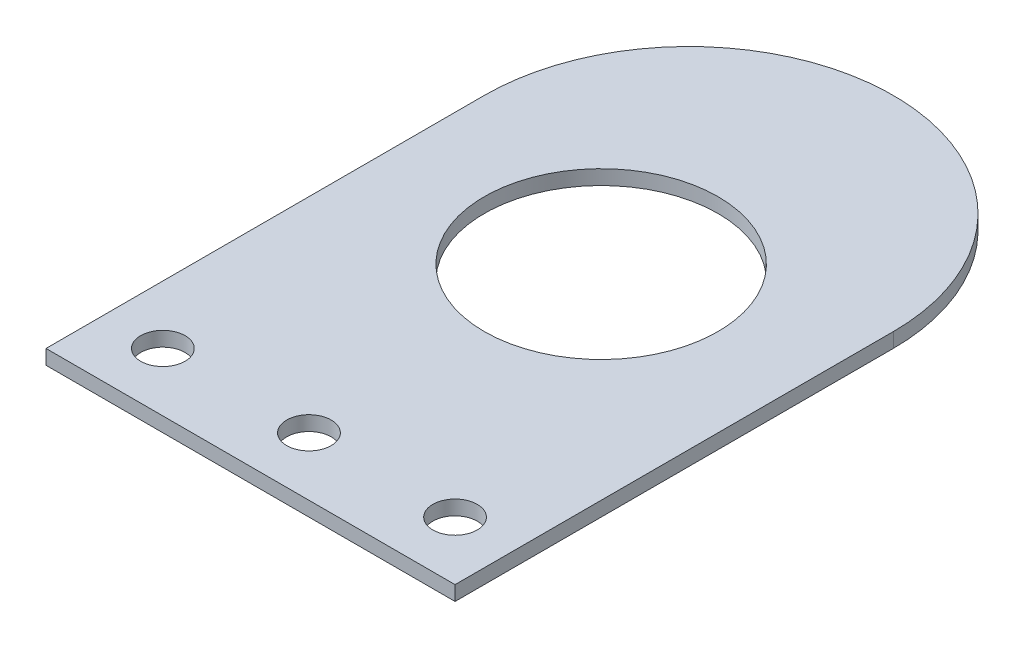
ISO-10303-21;
HEADER;
FILE_DESCRIPTION(('STEP AP214'),'2;1');
FILE_NAME('part.step','',(''),(''),'','','');
FILE_SCHEMA(('AUTOMOTIVE_DESIGN { 1 0 10303 214 1 1 1 1 }'));
ENDSEC;
DATA;
#1=APPLICATION_CONTEXT('core data for automotive mechanical design processes');
#2=APPLICATION_PROTOCOL_DEFINITION('international standard','automotive_design',2000,#1);
#3=PRODUCT_CONTEXT('',#1,'mechanical');
#4=PRODUCT('Part','Part','',(#3));
#5=PRODUCT_RELATED_PRODUCT_CATEGORY('part','',(#4));
#6=PRODUCT_DEFINITION_FORMATION('','',#4);
#7=PRODUCT_DEFINITION_CONTEXT('part definition',#1,'design');
#8=PRODUCT_DEFINITION('design','',#6,#7);
#9=PRODUCT_DEFINITION_SHAPE('','',#8);
#10=(LENGTH_UNIT() NAMED_UNIT(*) SI_UNIT(.MILLI.,.METRE.));
#11=(NAMED_UNIT(*) PLANE_ANGLE_UNIT() SI_UNIT($,.RADIAN.));
#12=(NAMED_UNIT(*) SI_UNIT($,.STERADIAN.) SOLID_ANGLE_UNIT());
#13=UNCERTAINTY_MEASURE_WITH_UNIT(LENGTH_MEASURE(1.E-05),#10,'distance_accuracy_value','');
#14=(GEOMETRIC_REPRESENTATION_CONTEXT(3) GLOBAL_UNCERTAINTY_ASSIGNED_CONTEXT((#13)) GLOBAL_UNIT_ASSIGNED_CONTEXT((#10,
#11,#12)) REPRESENTATION_CONTEXT('',''));
#15=CARTESIAN_POINT('',(0.,0.,0.));
#16=DIRECTION('',(0.,0.,1.));
#17=DIRECTION('',(1.,0.,0.));
#18=AXIS2_PLACEMENT_3D('',#15,#16,#17);
#19=CARTESIAN_POINT('',(0.,-1.5875,0.));
#20=DIRECTION('',(0.,1.,0.));
#21=DIRECTION('',(0.,0.,1.));
#22=AXIS2_PLACEMENT_3D('',#19,#20,#21);
#23=CYLINDRICAL_SURFACE('',#22,22.225);
#24=CARTESIAN_POINT('',(0.,0.,0.));
#25=DIRECTION('',(0.,1.,0.));
#26=DIRECTION('',(0.,0.,1.));
#27=AXIS2_PLACEMENT_3D('',#24,#25,#26);
#28=CIRCLE('',#27,22.225);
#29=CARTESIAN_POINT('',(22.225,0.,0.));
#30=VERTEX_POINT('',#29);
#31=CARTESIAN_POINT('',(-22.225,0.,0.));
#32=VERTEX_POINT('',#31);
#33=EDGE_CURVE('E118',#30,#32,#28,.T.);
#34=ORIENTED_EDGE('',*,*,#33,.F.);
#35=DIRECTION('',(0.,1.,0.));
#36=VECTOR('',#35,1.);
#37=CARTESIAN_POINT('',(22.225,-1.5875,0.));
#38=LINE('',#37,#36);
#39=CARTESIAN_POINT('',(22.225,-1.5875,0.));
#40=VERTEX_POINT('',#39);
#41=EDGE_CURVE('E13',#40,#30,#38,.T.);
#42=ORIENTED_EDGE('',*,*,#41,.F.);
#43=CARTESIAN_POINT('',(0.,-1.5875,0.));
#44=DIRECTION('',(0.,1.,0.));
#45=DIRECTION('',(0.,0.,1.));
#46=AXIS2_PLACEMENT_3D('',#43,#44,#45);
#47=CIRCLE('',#46,22.225);
#48=CARTESIAN_POINT('',(-22.225,-1.5875,0.));
#49=VERTEX_POINT('',#48);
#50=EDGE_CURVE('E111',#40,#49,#47,.T.);
#51=ORIENTED_EDGE('',*,*,#50,.T.);
#52=DIRECTION('',(0.,1.,0.));
#53=VECTOR('',#52,1.);
#54=CARTESIAN_POINT('',(-22.225,-1.5875,0.));
#55=LINE('',#54,#53);
#56=EDGE_CURVE('E56',#49,#32,#55,.T.);
#57=ORIENTED_EDGE('',*,*,#56,.T.);
#58=EDGE_LOOP('',(#34,#42,#51,#57));
#59=FACE_BOUND('',#58,.T.);
#60=ADVANCED_FACE('F53',(#59),#23,.T.);
#61=CARTESIAN_POINT('',(22.225,-1.5875,47.625));
#62=DIRECTION('',(1.,0.,0.));
#63=DIRECTION('',(0.,0.,-1.));
#64=AXIS2_PLACEMENT_3D('',#61,#62,#63);
#65=PLANE('',#64);
#66=DIRECTION('',(0.,0.,-1.));
#67=VECTOR('',#66,1.);
#68=CARTESIAN_POINT('',(22.225,0.,47.625));
#69=LINE('',#68,#67);
#70=CARTESIAN_POINT('',(22.225,0.,47.625));
#71=VERTEX_POINT('',#70);
#72=EDGE_CURVE('E113',#71,#30,#69,.T.);
#73=ORIENTED_EDGE('',*,*,#72,.F.);
#74=DIRECTION('',(0.,1.,0.));
#75=VECTOR('',#74,1.);
#76=CARTESIAN_POINT('',(22.225,-1.5875,47.625));
#77=LINE('',#76,#75);
#78=CARTESIAN_POINT('',(22.225,-1.5875,47.625));
#79=VERTEX_POINT('',#78);
#80=EDGE_CURVE('E62',#79,#71,#77,.T.);
#81=ORIENTED_EDGE('',*,*,#80,.F.);
#82=DIRECTION('',(0.,0.,-1.));
#83=VECTOR('',#82,1.);
#84=CARTESIAN_POINT('',(22.225,-1.5875,47.625));
#85=LINE('',#84,#83);
#86=EDGE_CURVE('E108',#79,#40,#85,.T.);
#87=ORIENTED_EDGE('',*,*,#86,.T.);
#88=ORIENTED_EDGE('',*,*,#41,.T.);
#89=EDGE_LOOP('',(#73,#81,#87,#88));
#90=FACE_BOUND('',#89,.T.);
#91=ADVANCED_FACE('F129',(#90),#65,.T.);
#92=CARTESIAN_POINT('',(-22.225,-1.5875,47.625));
#93=DIRECTION('',(0.,0.,1.));
#94=DIRECTION('',(1.,0.,0.));
#95=AXIS2_PLACEMENT_3D('',#92,#93,#94);
#96=PLANE('',#95);
#97=DIRECTION('',(1.,0.,0.));
#98=VECTOR('',#97,1.);
#99=CARTESIAN_POINT('',(-22.225,0.,47.625));
#100=LINE('',#99,#98);
#101=CARTESIAN_POINT('',(-22.225,0.,47.625));
#102=VERTEX_POINT('',#101);
#103=EDGE_CURVE('E103',#102,#71,#100,.T.);
#104=ORIENTED_EDGE('',*,*,#103,.F.);
#105=DIRECTION('',(0.,1.,0.));
#106=VECTOR('',#105,1.);
#107=CARTESIAN_POINT('',(-22.225,-1.5875,47.625));
#108=LINE('',#107,#106);
#109=CARTESIAN_POINT('',(-22.225,-1.5875,47.625));
#110=VERTEX_POINT('',#109);
#111=EDGE_CURVE('E98',#110,#102,#108,.T.);
#112=ORIENTED_EDGE('',*,*,#111,.F.);
#113=DIRECTION('',(1.,0.,0.));
#114=VECTOR('',#113,1.);
#115=CARTESIAN_POINT('',(-22.225,-1.5875,47.625));
#116=LINE('',#115,#114);
#117=EDGE_CURVE('E101',#110,#79,#116,.T.);
#118=ORIENTED_EDGE('',*,*,#117,.T.);
#119=ORIENTED_EDGE('',*,*,#80,.T.);
#120=EDGE_LOOP('',(#104,#112,#118,#119));
#121=FACE_BOUND('',#120,.T.);
#122=ADVANCED_FACE('F100',(#121),#96,.T.);
#123=CARTESIAN_POINT('',(-22.225,-1.5875,0.));
#124=DIRECTION('',(-1.,0.,0.));
#125=DIRECTION('',(0.,0.,1.));
#126=AXIS2_PLACEMENT_3D('',#123,#124,#125);
#127=PLANE('',#126);
#128=DIRECTION('',(0.,0.,1.));
#129=VECTOR('',#128,1.);
#130=CARTESIAN_POINT('',(-22.225,0.,0.));
#131=LINE('',#130,#129);
#132=EDGE_CURVE('E121',#32,#102,#131,.T.);
#133=ORIENTED_EDGE('',*,*,#132,.F.);
#134=ORIENTED_EDGE('',*,*,#56,.F.);
#135=DIRECTION('',(0.,0.,1.));
#136=VECTOR('',#135,1.);
#137=CARTESIAN_POINT('',(-22.225,-1.5875,0.));
#138=LINE('',#137,#136);
#139=EDGE_CURVE('E107',#49,#110,#138,.T.);
#140=ORIENTED_EDGE('',*,*,#139,.T.);
#141=ORIENTED_EDGE('',*,*,#111,.T.);
#142=EDGE_LOOP('',(#133,#134,#140,#141));
#143=FACE_BOUND('',#142,.T.);
#144=ADVANCED_FACE('F110',(#143),#127,.T.);
#145=CARTESIAN_POINT('',(0.,-1.5875,0.));
#146=DIRECTION('',(0.,1.,0.));
#147=DIRECTION('',(0.,0.,1.));
#148=AXIS2_PLACEMENT_3D('',#145,#146,#147);
#149=PLANE('',#148);
#150=CARTESIAN_POINT('',(-15.875,-1.5875,41.275));
#151=DIRECTION('',(0.,-1.,0.));
#152=DIRECTION('',(0.,0.,-1.));
#153=AXIS2_PLACEMENT_3D('',#150,#151,#152);
#154=CIRCLE('',#153,2.413);
#155=CARTESIAN_POINT('',(-15.875,-1.5875,38.862));
#156=VERTEX_POINT('',#155);
#157=EDGE_CURVE('E173',#156,#156,#154,.T.);
#158=ORIENTED_EDGE('',*,*,#157,.F.);
#159=EDGE_LOOP('',(#158));
#160=FACE_BOUND('',#159,.T.);
#161=CARTESIAN_POINT('',(0.,-1.5875,41.275));
#162=DIRECTION('',(0.,-1.,0.));
#163=DIRECTION('',(0.,0.,-1.));
#164=AXIS2_PLACEMENT_3D('',#161,#162,#163);
#165=CIRCLE('',#164,2.413);
#166=CARTESIAN_POINT('',(0.,-1.5875,38.862));
#167=VERTEX_POINT('',#166);
#168=EDGE_CURVE('E175',#167,#167,#165,.T.);
#169=ORIENTED_EDGE('',*,*,#168,.F.);
#170=EDGE_LOOP('',(#169));
#171=FACE_BOUND('',#170,.T.);
#172=CARTESIAN_POINT('',(15.875,-1.5875,41.275));
#173=DIRECTION('',(0.,-1.,0.));
#174=DIRECTION('',(0.,0.,-1.));
#175=AXIS2_PLACEMENT_3D('',#172,#173,#174);
#176=CIRCLE('',#175,2.413);
#177=CARTESIAN_POINT('',(15.875,-1.5875,38.862));
#178=VERTEX_POINT('',#177);
#179=EDGE_CURVE('E181',#178,#178,#176,.T.);
#180=ORIENTED_EDGE('',*,*,#179,.F.);
#181=EDGE_LOOP('',(#180));
#182=FACE_BOUND('',#181,.T.);
#183=CARTESIAN_POINT('',(0.,-1.5875,9.52499999999998));
#184=DIRECTION('',(0.,1.,0.));
#185=DIRECTION('',(0.,0.,1.));
#186=AXIS2_PLACEMENT_3D('',#183,#184,#185);
#187=CIRCLE('',#186,12.7);
#188=CARTESIAN_POINT('',(0.,-1.5875,22.225));
#189=VERTEX_POINT('',#188);
#190=EDGE_CURVE('E122',#189,#189,#187,.T.);
#191=ORIENTED_EDGE('',*,*,#190,.T.);
#192=EDGE_LOOP('',(#191));
#193=FACE_BOUND('',#192,.T.);
#194=ORIENTED_EDGE('',*,*,#50,.F.);
#195=ORIENTED_EDGE('',*,*,#86,.F.);
#196=ORIENTED_EDGE('',*,*,#117,.F.);
#197=ORIENTED_EDGE('',*,*,#139,.F.);
#198=EDGE_LOOP('',(#194,#195,#196,#197));
#199=FACE_BOUND('',#198,.T.);
#200=ADVANCED_FACE('F106',(#160,#171,#182,#193,#199),#149,.F.);
#201=CARTESIAN_POINT('',(0.,0.,0.));
#202=DIRECTION('',(0.,1.,0.));
#203=DIRECTION('',(0.,0.,1.));
#204=AXIS2_PLACEMENT_3D('',#201,#202,#203);
#205=PLANE('',#204);
#206=CARTESIAN_POINT('',(-15.875,0.,41.275));
#207=DIRECTION('',(0.,-1.,0.));
#208=DIRECTION('',(0.,0.,-1.));
#209=AXIS2_PLACEMENT_3D('',#206,#207,#208);
#210=CIRCLE('',#209,2.413);
#211=CARTESIAN_POINT('',(-15.875,0.,38.862));
#212=VERTEX_POINT('',#211);
#213=EDGE_CURVE('E171',#212,#212,#210,.T.);
#214=ORIENTED_EDGE('',*,*,#213,.T.);
#215=EDGE_LOOP('',(#214));
#216=FACE_BOUND('',#215,.T.);
#217=CARTESIAN_POINT('',(0.,0.,41.275));
#218=DIRECTION('',(0.,-1.,0.));
#219=DIRECTION('',(0.,0.,-1.));
#220=AXIS2_PLACEMENT_3D('',#217,#218,#219);
#221=CIRCLE('',#220,2.413);
#222=CARTESIAN_POINT('',(0.,0.,38.862));
#223=VERTEX_POINT('',#222);
#224=EDGE_CURVE('E178',#223,#223,#221,.T.);
#225=ORIENTED_EDGE('',*,*,#224,.T.);
#226=EDGE_LOOP('',(#225));
#227=FACE_BOUND('',#226,.T.);
#228=CARTESIAN_POINT('',(15.875,0.,41.275));
#229=DIRECTION('',(0.,-1.,0.));
#230=DIRECTION('',(0.,0.,-1.));
#231=AXIS2_PLACEMENT_3D('',#228,#229,#230);
#232=CIRCLE('',#231,2.413);
#233=CARTESIAN_POINT('',(15.875,0.,38.862));
#234=VERTEX_POINT('',#233);
#235=EDGE_CURVE('E184',#234,#234,#232,.T.);
#236=ORIENTED_EDGE('',*,*,#235,.T.);
#237=EDGE_LOOP('',(#236));
#238=FACE_BOUND('',#237,.T.);
#239=CARTESIAN_POINT('',(0.,0.,9.52499999999998));
#240=DIRECTION('',(0.,1.,0.));
#241=DIRECTION('',(0.,0.,1.));
#242=AXIS2_PLACEMENT_3D('',#239,#240,#241);
#243=CIRCLE('',#242,12.7);
#244=CARTESIAN_POINT('',(0.,0.,22.225));
#245=VERTEX_POINT('',#244);
#246=EDGE_CURVE('E187',#245,#245,#243,.T.);
#247=ORIENTED_EDGE('',*,*,#246,.F.);
#248=EDGE_LOOP('',(#247));
#249=FACE_BOUND('',#248,.T.);
#250=ORIENTED_EDGE('',*,*,#33,.T.);
#251=ORIENTED_EDGE('',*,*,#132,.T.);
#252=ORIENTED_EDGE('',*,*,#103,.T.);
#253=ORIENTED_EDGE('',*,*,#72,.T.);
#254=EDGE_LOOP('',(#250,#251,#252,#253));
#255=FACE_BOUND('',#254,.T.);
#256=ADVANCED_FACE('F128',(#216,#227,#238,#249,#255),#205,.T.);
#257=CARTESIAN_POINT('',(0.,-1.5875,9.52499999999998));
#258=DIRECTION('',(0.,1.,0.));
#259=DIRECTION('',(0.,0.,1.));
#260=AXIS2_PLACEMENT_3D('',#257,#258,#259);
#261=CYLINDRICAL_SURFACE('',#260,12.7);
#262=ORIENTED_EDGE('',*,*,#190,.F.);
#263=EDGE_LOOP('',(#262));
#264=FACE_BOUND('',#263,.T.);
#265=ORIENTED_EDGE('',*,*,#246,.T.);
#266=EDGE_LOOP('',(#265));
#267=FACE_BOUND('',#266,.T.);
#268=ADVANCED_FACE('F147',(#264,#267),#261,.F.);
#269=CARTESIAN_POINT('',(15.875,0.,41.275));
#270=DIRECTION('',(0.,-1.,0.));
#271=DIRECTION('',(0.,0.,-1.));
#272=AXIS2_PLACEMENT_3D('',#269,#270,#271);
#273=CYLINDRICAL_SURFACE('',#272,2.413);
#274=ORIENTED_EDGE('',*,*,#235,.F.);
#275=EDGE_LOOP('',(#274));
#276=FACE_BOUND('',#275,.T.);
#277=ORIENTED_EDGE('',*,*,#179,.T.);
#278=EDGE_LOOP('',(#277));
#279=FACE_BOUND('',#278,.T.);
#280=ADVANCED_FACE('F154',(#276,#279),#273,.F.);
#281=CARTESIAN_POINT('',(0.,0.,41.275));
#282=DIRECTION('',(0.,-1.,0.));
#283=DIRECTION('',(0.,0.,-1.));
#284=AXIS2_PLACEMENT_3D('',#281,#282,#283);
#285=CYLINDRICAL_SURFACE('',#284,2.413);
#286=ORIENTED_EDGE('',*,*,#224,.F.);
#287=EDGE_LOOP('',(#286));
#288=FACE_BOUND('',#287,.T.);
#289=ORIENTED_EDGE('',*,*,#168,.T.);
#290=EDGE_LOOP('',(#289));
#291=FACE_BOUND('',#290,.T.);
#292=ADVANCED_FACE('F158',(#288,#291),#285,.F.);
#293=CARTESIAN_POINT('',(-15.875,0.,41.275));
#294=DIRECTION('',(0.,-1.,0.));
#295=DIRECTION('',(0.,0.,-1.));
#296=AXIS2_PLACEMENT_3D('',#293,#294,#295);
#297=CYLINDRICAL_SURFACE('',#296,2.413);
#298=ORIENTED_EDGE('',*,*,#213,.F.);
#299=EDGE_LOOP('',(#298));
#300=FACE_BOUND('',#299,.T.);
#301=ORIENTED_EDGE('',*,*,#157,.T.);
#302=EDGE_LOOP('',(#301));
#303=FACE_BOUND('',#302,.T.);
#304=ADVANCED_FACE('F162',(#300,#303),#297,.F.);
#305=CLOSED_SHELL('',(#60,#91,#122,#144,#200,#256,#268,#280,#292,#304));
#306=MANIFOLD_SOLID_BREP('B2',#305);
#307=ADVANCED_BREP_SHAPE_REPRESENTATION('',(#18,#306),#14);
#308=SHAPE_DEFINITION_REPRESENTATION(#9,#307);
ENDSEC;
END-ISO-10303-21;
